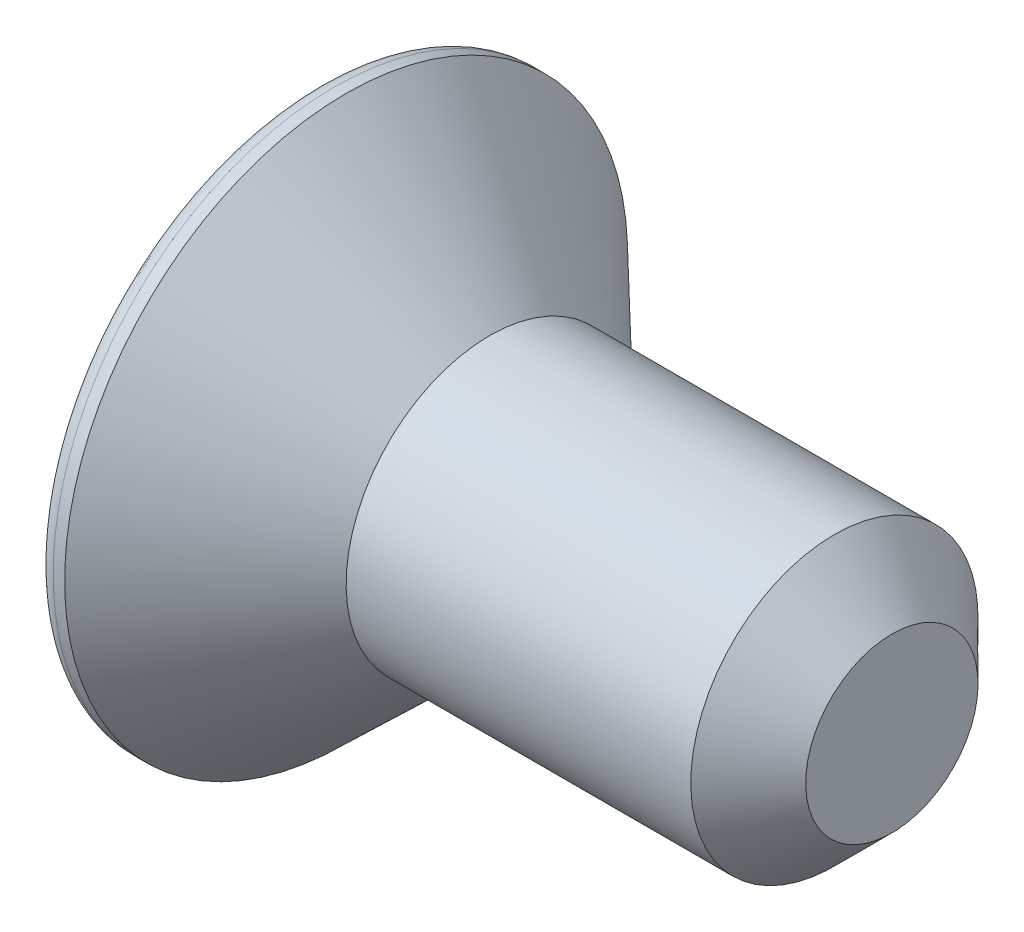
ISO-10303-21;
HEADER;
FILE_DESCRIPTION(('STEP AP214'),'2;1');
FILE_NAME('part.step','',(''),(''),'','','');
FILE_SCHEMA(('AUTOMOTIVE_DESIGN { 1 0 10303 214 1 1 1 1 }'));
ENDSEC;
DATA;
#1=APPLICATION_CONTEXT('core data for automotive mechanical design processes');
#2=APPLICATION_PROTOCOL_DEFINITION('international standard','automotive_design',2000,#1);
#3=PRODUCT_CONTEXT('',#1,'mechanical');
#4=PRODUCT('Part','Part','',(#3));
#5=PRODUCT_RELATED_PRODUCT_CATEGORY('part','',(#4));
#6=PRODUCT_DEFINITION_FORMATION('','',#4);
#7=PRODUCT_DEFINITION_CONTEXT('part definition',#1,'design');
#8=PRODUCT_DEFINITION('design','',#6,#7);
#9=PRODUCT_DEFINITION_SHAPE('','',#8);
#10=(LENGTH_UNIT() NAMED_UNIT(*) SI_UNIT(.MILLI.,.METRE.));
#11=(NAMED_UNIT(*) PLANE_ANGLE_UNIT() SI_UNIT($,.RADIAN.));
#12=(NAMED_UNIT(*) SI_UNIT($,.STERADIAN.) SOLID_ANGLE_UNIT());
#13=UNCERTAINTY_MEASURE_WITH_UNIT(LENGTH_MEASURE(1.E-05),#10,'distance_accuracy_value','');
#14=(GEOMETRIC_REPRESENTATION_CONTEXT(3) GLOBAL_UNCERTAINTY_ASSIGNED_CONTEXT((#13)) GLOBAL_UNIT_ASSIGNED_CONTEXT((#10,
#11,#12)) REPRESENTATION_CONTEXT('',''));
#15=CARTESIAN_POINT('',(0.,0.,0.));
#16=DIRECTION('',(0.,0.,1.));
#17=DIRECTION('',(1.,0.,0.));
#18=AXIS2_PLACEMENT_3D('',#15,#16,#17);
#19=CARTESIAN_POINT('',(0.,0.,0.));
#20=DIRECTION('',(-1.,0.,0.));
#21=DIRECTION('',(0.,-1.,0.));
#22=AXIS2_PLACEMENT_3D('',#19,#20,#21);
#23=PLANE('',#22);
#24=CARTESIAN_POINT('',(0.,0.,0.));
#25=DIRECTION('',(-1.,0.,0.));
#26=DIRECTION('',(0.,-1.,0.));
#27=AXIS2_PLACEMENT_3D('',#24,#25,#26);
#28=CIRCLE('',#27,4.6);
#29=CARTESIAN_POINT('',(0.,-4.6,0.));
#30=VERTEX_POINT('',#29);
#31=EDGE_CURVE('E155',#30,#30,#28,.T.);
#32=ORIENTED_EDGE('',*,*,#31,.T.);
#33=EDGE_LOOP('',(#32));
#34=FACE_BOUND('',#33,.T.);
#35=DIRECTION('',(0.,0.866025403784438,-0.5));
#36=VECTOR('',#35,1.);
#37=CARTESIAN_POINT('',(0.,0.,1.73205080756888));
#38=LINE('',#37,#36);
#39=CARTESIAN_POINT('',(0.,0.,1.73205080756888));
#40=VERTEX_POINT('',#39);
#41=CARTESIAN_POINT('',(0.,1.5,0.866025403784438));
#42=VERTEX_POINT('',#41);
#43=EDGE_CURVE('E54',#40,#42,#38,.T.);
#44=ORIENTED_EDGE('',*,*,#43,.F.);
#45=DIRECTION('',(0.,0.866025403784438,0.5));
#46=VECTOR('',#45,1.);
#47=CARTESIAN_POINT('',(0.,-1.5,0.866025403784439));
#48=LINE('',#47,#46);
#49=CARTESIAN_POINT('',(0.,-1.5,0.866025403784439));
#50=VERTEX_POINT('',#49);
#51=EDGE_CURVE('E137',#50,#40,#48,.T.);
#52=ORIENTED_EDGE('',*,*,#51,.F.);
#53=DIRECTION('',(0.,0.,1.));
#54=VECTOR('',#53,1.);
#55=CARTESIAN_POINT('',(0.,-1.5,-0.866025403784438));
#56=LINE('',#55,#54);
#57=CARTESIAN_POINT('',(0.,-1.5,-0.866025403784438));
#58=VERTEX_POINT('',#57);
#59=EDGE_CURVE('E135',#58,#50,#56,.T.);
#60=ORIENTED_EDGE('',*,*,#59,.F.);
#61=DIRECTION('',(0.,-0.866025403784439,0.5));
#62=VECTOR('',#61,1.);
#63=CARTESIAN_POINT('',(0.,0.,-1.73205080756888));
#64=LINE('',#63,#62);
#65=CARTESIAN_POINT('',(0.,0.,-1.73205080756888));
#66=VERTEX_POINT('',#65);
#67=EDGE_CURVE('E102',#66,#58,#64,.T.);
#68=ORIENTED_EDGE('',*,*,#67,.F.);
#69=DIRECTION('',(0.,-0.866025403784439,-0.5));
#70=VECTOR('',#69,1.);
#71=CARTESIAN_POINT('',(0.,1.5,-0.866025403784439));
#72=LINE('',#71,#70);
#73=CARTESIAN_POINT('',(0.,1.5,-0.866025403784439));
#74=VERTEX_POINT('',#73);
#75=EDGE_CURVE('E131',#74,#66,#72,.T.);
#76=ORIENTED_EDGE('',*,*,#75,.F.);
#77=DIRECTION('',(0.,0.,-1.));
#78=VECTOR('',#77,1.);
#79=CARTESIAN_POINT('',(0.,1.5,0.866025403784438));
#80=LINE('',#79,#78);
#81=EDGE_CURVE('E128',#42,#74,#80,.T.);
#82=ORIENTED_EDGE('',*,*,#81,.F.);
#83=EDGE_LOOP('',(#44,#52,#60,#68,#76,#82));
#84=FACE_BOUND('',#83,.T.);
#85=ADVANCED_FACE('F38',(#34,#84),#23,.T.);
#86=CARTESIAN_POINT('',(10.,0.,0.));
#87=DIRECTION('',(1.,0.,0.));
#88=DIRECTION('',(0.,1.,0.));
#89=AXIS2_PLACEMENT_3D('',#86,#87,#88);
#90=CYLINDRICAL_SURFACE('',#89,4.9);
#91=CARTESIAN_POINT('',(0.3,0.,0.));
#92=DIRECTION('',(-1.,0.,0.));
#93=DIRECTION('',(0.,-1.,0.));
#94=AXIS2_PLACEMENT_3D('',#91,#92,#93);
#95=CIRCLE('',#94,4.9);
#96=CARTESIAN_POINT('',(0.3,-4.9,0.));
#97=VERTEX_POINT('',#96);
#98=EDGE_CURVE('E152',#97,#97,#95,.F.);
#99=ORIENTED_EDGE('',*,*,#98,.T.);
#100=EDGE_LOOP('',(#99));
#101=FACE_BOUND('',#100,.T.);
#102=CARTESIAN_POINT('',(0.5,0.,0.));
#103=DIRECTION('',(1.,0.,0.));
#104=DIRECTION('',(0.,1.,0.));
#105=AXIS2_PLACEMENT_3D('',#102,#103,#104);
#106=CIRCLE('',#105,4.9);
#107=CARTESIAN_POINT('',(0.5,4.9,0.));
#108=VERTEX_POINT('',#107);
#109=EDGE_CURVE('E149',#108,#108,#106,.T.);
#110=ORIENTED_EDGE('',*,*,#109,.F.);
#111=EDGE_LOOP('',(#110));
#112=FACE_BOUND('',#111,.T.);
#113=ADVANCED_FACE('F171',(#101,#112),#90,.T.);
#114=CARTESIAN_POINT('',(3.,0.,0.));
#115=DIRECTION('',(-1.,0.,0.));
#116=DIRECTION('',(0.,-1.,0.));
#117=AXIS2_PLACEMENT_3D('',#114,#115,#116);
#118=CONICAL_SURFACE('',#117,2.5,0.76499283271091);
#119=ORIENTED_EDGE('',*,*,#109,.T.);
#120=EDGE_LOOP('',(#119));
#121=FACE_BOUND('',#120,.T.);
#122=CARTESIAN_POINT('',(3.,0.,0.));
#123=DIRECTION('',(1.,0.,0.));
#124=DIRECTION('',(0.,1.,0.));
#125=AXIS2_PLACEMENT_3D('',#122,#123,#124);
#126=CIRCLE('',#125,2.5);
#127=CARTESIAN_POINT('',(3.,2.5,0.));
#128=VERTEX_POINT('',#127);
#129=EDGE_CURVE('E141',#128,#128,#126,.T.);
#130=ORIENTED_EDGE('',*,*,#129,.F.);
#131=EDGE_LOOP('',(#130));
#132=FACE_BOUND('',#131,.T.);
#133=ADVANCED_FACE('F177',(#121,#132),#118,.T.);
#134=CARTESIAN_POINT('',(10.,0.,0.));
#135=DIRECTION('',(1.,0.,0.));
#136=DIRECTION('',(0.,1.,0.));
#137=AXIS2_PLACEMENT_3D('',#134,#135,#136);
#138=CYLINDRICAL_SURFACE('',#137,2.5);
#139=CARTESIAN_POINT('',(9.,0.,0.));
#140=DIRECTION('',(1.,0.,0.));
#141=DIRECTION('',(0.,1.,0.));
#142=AXIS2_PLACEMENT_3D('',#139,#140,#141);
#143=CIRCLE('',#142,2.5);
#144=CARTESIAN_POINT('',(9.,2.5,0.));
#145=VERTEX_POINT('',#144);
#146=EDGE_CURVE('E11',#145,#145,#143,.F.);
#147=ORIENTED_EDGE('',*,*,#146,.T.);
#148=EDGE_LOOP('',(#147));
#149=FACE_BOUND('',#148,.T.);
#150=ORIENTED_EDGE('',*,*,#129,.T.);
#151=EDGE_LOOP('',(#150));
#152=FACE_BOUND('',#151,.T.);
#153=ADVANCED_FACE('F184',(#149,#152),#138,.T.);
#154=CARTESIAN_POINT('',(10.,2.5,0.));
#155=DIRECTION('',(1.,0.,0.));
#156=DIRECTION('',(0.,1.,0.));
#157=AXIS2_PLACEMENT_3D('',#154,#155,#156);
#158=PLANE('',#157);
#159=CARTESIAN_POINT('',(10.,0.,0.));
#160=DIRECTION('',(1.,0.,0.));
#161=DIRECTION('',(0.,1.,0.));
#162=AXIS2_PLACEMENT_3D('',#159,#160,#161);
#163=CIRCLE('',#162,1.5);
#164=CARTESIAN_POINT('',(10.,1.50000000000001,0.));
#165=VERTEX_POINT('',#164);
#166=EDGE_CURVE('E47',#165,#165,#163,.T.);
#167=ORIENTED_EDGE('',*,*,#166,.T.);
#168=EDGE_LOOP('',(#167));
#169=FACE_BOUND('',#168,.T.);
#170=ADVANCED_FACE('F160',(#169),#158,.T.);
#171=CARTESIAN_POINT('',(2.,0.,1.73205080756888));
#172=DIRECTION('',(0.,0.5,0.866025403784439));
#173=DIRECTION('',(0.,-0.866025403784438,0.5));
#174=AXIS2_PLACEMENT_3D('',#171,#172,#173);
#175=PLANE('',#174);
#176=ORIENTED_EDGE('',*,*,#43,.T.);
#177=DIRECTION('',(-1.,0.,0.));
#178=VECTOR('',#177,1.);
#179=CARTESIAN_POINT('',(2.,1.5,0.866025403784438));
#180=LINE('',#179,#178);
#181=CARTESIAN_POINT('',(2.,1.5,0.866025403784438));
#182=VERTEX_POINT('',#181);
#183=EDGE_CURVE('E84',#182,#42,#180,.T.);
#184=ORIENTED_EDGE('',*,*,#183,.F.);
#185=DIRECTION('',(0.,0.866025403784438,-0.5));
#186=VECTOR('',#185,1.);
#187=CARTESIAN_POINT('',(2.,0.,1.73205080756888));
#188=LINE('',#187,#186);
#189=CARTESIAN_POINT('',(2.,0.,1.73205080756888));
#190=VERTEX_POINT('',#189);
#191=EDGE_CURVE('E139',#190,#182,#188,.T.);
#192=ORIENTED_EDGE('',*,*,#191,.F.);
#193=DIRECTION('',(-1.,0.,0.));
#194=VECTOR('',#193,1.);
#195=CARTESIAN_POINT('',(2.,0.,1.73205080756888));
#196=LINE('',#195,#194);
#197=EDGE_CURVE('E62',#190,#40,#196,.T.);
#198=ORIENTED_EDGE('',*,*,#197,.T.);
#199=EDGE_LOOP('',(#176,#184,#192,#198));
#200=FACE_BOUND('',#199,.T.);
#201=ADVANCED_FACE('F191',(#200),#175,.F.);
#202=CARTESIAN_POINT('',(2.,-1.5,0.866025403784439));
#203=DIRECTION('',(0.,-0.5,0.866025403784438));
#204=DIRECTION('',(0.,-0.866025403784439,-0.5));
#205=AXIS2_PLACEMENT_3D('',#202,#203,#204);
#206=PLANE('',#205);
#207=ORIENTED_EDGE('',*,*,#51,.T.);
#208=ORIENTED_EDGE('',*,*,#197,.F.);
#209=DIRECTION('',(0.,0.866025403784438,0.5));
#210=VECTOR('',#209,1.);
#211=CARTESIAN_POINT('',(2.,-1.5,0.866025403784439));
#212=LINE('',#211,#210);
#213=CARTESIAN_POINT('',(2.,-1.5,0.866025403784439));
#214=VERTEX_POINT('',#213);
#215=EDGE_CURVE('E114',#214,#190,#212,.T.);
#216=ORIENTED_EDGE('',*,*,#215,.F.);
#217=DIRECTION('',(-1.,0.,0.));
#218=VECTOR('',#217,1.);
#219=CARTESIAN_POINT('',(2.,-1.5,0.866025403784439));
#220=LINE('',#219,#218);
#221=EDGE_CURVE('E106',#214,#50,#220,.T.);
#222=ORIENTED_EDGE('',*,*,#221,.T.);
#223=EDGE_LOOP('',(#207,#208,#216,#222));
#224=FACE_BOUND('',#223,.T.);
#225=ADVANCED_FACE('F194',(#224),#206,.F.);
#226=CARTESIAN_POINT('',(2.,-1.5,-0.866025403784438));
#227=DIRECTION('',(0.,-1.,0.));
#228=DIRECTION('',(0.,0.,-1.));
#229=AXIS2_PLACEMENT_3D('',#226,#227,#228);
#230=PLANE('',#229);
#231=ORIENTED_EDGE('',*,*,#59,.T.);
#232=ORIENTED_EDGE('',*,*,#221,.F.);
#233=DIRECTION('',(0.,0.,1.));
#234=VECTOR('',#233,1.);
#235=CARTESIAN_POINT('',(2.,-1.5,-0.866025403784438));
#236=LINE('',#235,#234);
#237=CARTESIAN_POINT('',(2.,-1.5,-0.866025403784438));
#238=VERTEX_POINT('',#237);
#239=EDGE_CURVE('E110',#238,#214,#236,.T.);
#240=ORIENTED_EDGE('',*,*,#239,.F.);
#241=DIRECTION('',(-1.,0.,0.));
#242=VECTOR('',#241,1.);
#243=CARTESIAN_POINT('',(2.,-1.5,-0.866025403784438));
#244=LINE('',#243,#242);
#245=EDGE_CURVE('E95',#238,#58,#244,.T.);
#246=ORIENTED_EDGE('',*,*,#245,.T.);
#247=EDGE_LOOP('',(#231,#232,#240,#246));
#248=FACE_BOUND('',#247,.T.);
#249=ADVANCED_FACE('F111',(#248),#230,.F.);
#250=CARTESIAN_POINT('',(2.,0.,-1.73205080756888));
#251=DIRECTION('',(0.,-0.5,-0.866025403784439));
#252=DIRECTION('',(0.,0.866025403784439,-0.5));
#253=AXIS2_PLACEMENT_3D('',#250,#251,#252);
#254=PLANE('',#253);
#255=ORIENTED_EDGE('',*,*,#67,.T.);
#256=ORIENTED_EDGE('',*,*,#245,.F.);
#257=DIRECTION('',(0.,-0.866025403784439,0.5));
#258=VECTOR('',#257,1.);
#259=CARTESIAN_POINT('',(2.,0.,-1.73205080756888));
#260=LINE('',#259,#258);
#261=CARTESIAN_POINT('',(2.,0.,-1.73205080756888));
#262=VERTEX_POINT('',#261);
#263=EDGE_CURVE('E99',#262,#238,#260,.T.);
#264=ORIENTED_EDGE('',*,*,#263,.F.);
#265=DIRECTION('',(-1.,0.,0.));
#266=VECTOR('',#265,1.);
#267=CARTESIAN_POINT('',(2.,0.,-1.73205080756888));
#268=LINE('',#267,#266);
#269=EDGE_CURVE('E107',#262,#66,#268,.T.);
#270=ORIENTED_EDGE('',*,*,#269,.T.);
#271=EDGE_LOOP('',(#255,#256,#264,#270));
#272=FACE_BOUND('',#271,.T.);
#273=ADVANCED_FACE('F97',(#272),#254,.F.);
#274=CARTESIAN_POINT('',(2.,1.5,-0.866025403784439));
#275=DIRECTION('',(0.,0.5,-0.866025403784439));
#276=DIRECTION('',(0.,0.866025403784439,0.5));
#277=AXIS2_PLACEMENT_3D('',#274,#275,#276);
#278=PLANE('',#277);
#279=ORIENTED_EDGE('',*,*,#75,.T.);
#280=ORIENTED_EDGE('',*,*,#269,.F.);
#281=DIRECTION('',(0.,-0.866025403784439,-0.5));
#282=VECTOR('',#281,1.);
#283=CARTESIAN_POINT('',(2.,1.5,-0.866025403784439));
#284=LINE('',#283,#282);
#285=CARTESIAN_POINT('',(2.,1.5,-0.866025403784439));
#286=VERTEX_POINT('',#285);
#287=EDGE_CURVE('E120',#286,#262,#284,.T.);
#288=ORIENTED_EDGE('',*,*,#287,.F.);
#289=DIRECTION('',(-1.,0.,0.));
#290=VECTOR('',#289,1.);
#291=CARTESIAN_POINT('',(2.,1.5,-0.866025403784439));
#292=LINE('',#291,#290);
#293=EDGE_CURVE('E144',#286,#74,#292,.T.);
#294=ORIENTED_EDGE('',*,*,#293,.T.);
#295=EDGE_LOOP('',(#279,#280,#288,#294));
#296=FACE_BOUND('',#295,.T.);
#297=ADVANCED_FACE('F198',(#296),#278,.F.);
#298=CARTESIAN_POINT('',(2.,1.5,0.866025403784438));
#299=DIRECTION('',(0.,1.,0.));
#300=DIRECTION('',(0.,0.,1.));
#301=AXIS2_PLACEMENT_3D('',#298,#299,#300);
#302=PLANE('',#301);
#303=ORIENTED_EDGE('',*,*,#81,.T.);
#304=ORIENTED_EDGE('',*,*,#293,.F.);
#305=DIRECTION('',(0.,0.,-1.));
#306=VECTOR('',#305,1.);
#307=CARTESIAN_POINT('',(2.,1.5,0.866025403784438));
#308=LINE('',#307,#306);
#309=EDGE_CURVE('E122',#182,#286,#308,.T.);
#310=ORIENTED_EDGE('',*,*,#309,.F.);
#311=ORIENTED_EDGE('',*,*,#183,.T.);
#312=EDGE_LOOP('',(#303,#304,#310,#311));
#313=FACE_BOUND('',#312,.T.);
#314=ADVANCED_FACE('F195',(#313),#302,.F.);
#315=CARTESIAN_POINT('',(2.,0.,0.));
#316=DIRECTION('',(-1.,0.,0.));
#317=DIRECTION('',(0.,0.,1.));
#318=AXIS2_PLACEMENT_3D('',#315,#316,#317);
#319=PLANE('',#318);
#320=ORIENTED_EDGE('',*,*,#191,.T.);
#321=ORIENTED_EDGE('',*,*,#309,.T.);
#322=ORIENTED_EDGE('',*,*,#287,.T.);
#323=ORIENTED_EDGE('',*,*,#263,.T.);
#324=ORIENTED_EDGE('',*,*,#239,.T.);
#325=ORIENTED_EDGE('',*,*,#215,.T.);
#326=EDGE_LOOP('',(#320,#321,#322,#323,#324,#325));
#327=FACE_BOUND('',#326,.T.);
#328=ADVANCED_FACE('F117',(#327),#319,.T.);
#329=CARTESIAN_POINT('',(0.3,0.,0.));
#330=DIRECTION('',(-1.,0.,0.));
#331=DIRECTION('',(0.,-1.,0.));
#332=AXIS2_PLACEMENT_3D('',#329,#330,#331);
#333=TOROIDAL_SURFACE('',#332,4.6,0.3);
#334=ORIENTED_EDGE('',*,*,#31,.F.);
#335=EDGE_LOOP('',(#334));
#336=FACE_BOUND('',#335,.T.);
#337=ORIENTED_EDGE('',*,*,#98,.F.);
#338=EDGE_LOOP('',(#337));
#339=FACE_BOUND('',#338,.T.);
#340=ADVANCED_FACE('F163',(#336,#339),#333,.T.);
#341=CARTESIAN_POINT('',(10.,0.,0.));
#342=DIRECTION('',(-1.,0.,0.));
#343=DIRECTION('',(0.,-1.,0.));
#344=AXIS2_PLACEMENT_3D('',#341,#342,#343);
#345=CONICAL_SURFACE('',#344,1.5,0.785398163397447);
#346=ORIENTED_EDGE('',*,*,#146,.F.);
#347=EDGE_LOOP('',(#346));
#348=FACE_BOUND('',#347,.T.);
#349=ORIENTED_EDGE('',*,*,#166,.F.);
#350=EDGE_LOOP('',(#349));
#351=FACE_BOUND('',#350,.T.);
#352=ADVANCED_FACE('F41',(#348,#351),#345,.T.);
#353=CLOSED_SHELL('',(#85,#113,#133,#153,#170,#201,#225,#249,#273,#297,#314,#328,#340,#352));
#354=MANIFOLD_SOLID_BREP('B2',#353);
#355=ADVANCED_BREP_SHAPE_REPRESENTATION('',(#18,#354),#14);
#356=SHAPE_DEFINITION_REPRESENTATION(#9,#355);
ENDSEC;
END-ISO-10303-21;
